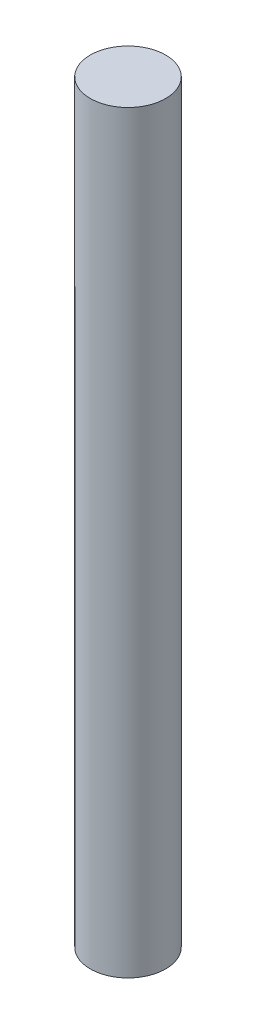
ISO-10303-21;
HEADER;
FILE_DESCRIPTION(('STEP AP214'),'2;1');
FILE_NAME('part.step','',(''),(''),'','','');
FILE_SCHEMA(('AUTOMOTIVE_DESIGN { 1 0 10303 214 1 1 1 1 }'));
ENDSEC;
DATA;
#1=APPLICATION_CONTEXT('core data for automotive mechanical design processes');
#2=APPLICATION_PROTOCOL_DEFINITION('international standard','automotive_design',2000,#1);
#3=PRODUCT_CONTEXT('',#1,'mechanical');
#4=PRODUCT('Part','Part','',(#3));
#5=PRODUCT_RELATED_PRODUCT_CATEGORY('part','',(#4));
#6=PRODUCT_DEFINITION_FORMATION('','',#4);
#7=PRODUCT_DEFINITION_CONTEXT('part definition',#1,'design');
#8=PRODUCT_DEFINITION('design','',#6,#7);
#9=PRODUCT_DEFINITION_SHAPE('','',#8);
#10=(LENGTH_UNIT() NAMED_UNIT(*) SI_UNIT(.MILLI.,.METRE.));
#11=(NAMED_UNIT(*) PLANE_ANGLE_UNIT() SI_UNIT($,.RADIAN.));
#12=(NAMED_UNIT(*) SI_UNIT($,.STERADIAN.) SOLID_ANGLE_UNIT());
#13=UNCERTAINTY_MEASURE_WITH_UNIT(LENGTH_MEASURE(1.E-05),#10,'distance_accuracy_value','');
#14=(GEOMETRIC_REPRESENTATION_CONTEXT(3) GLOBAL_UNCERTAINTY_ASSIGNED_CONTEXT((#13)) GLOBAL_UNIT_ASSIGNED_CONTEXT((#10,
#11,#12)) REPRESENTATION_CONTEXT('',''));
#15=CARTESIAN_POINT('',(0.,0.,0.));
#16=DIRECTION('',(0.,0.,1.));
#17=DIRECTION('',(1.,0.,0.));
#18=AXIS2_PLACEMENT_3D('',#15,#16,#17);
#19=CARTESIAN_POINT('',(3.74999999999999,75.,0.));
#20=DIRECTION('',(0.,1.,0.));
#21=DIRECTION('',(-1.,0.,0.));
#22=AXIS2_PLACEMENT_3D('',#19,#20,#21);
#23=CYLINDRICAL_SURFACE('',#22,7.5);
#24=CARTESIAN_POINT('',(3.75000000000001,-75.,0.));
#25=DIRECTION('',(0.,1.,0.));
#26=DIRECTION('',(-1.,0.,0.));
#27=AXIS2_PLACEMENT_3D('',#24,#25,#26);
#28=CIRCLE('',#27,7.5);
#29=CARTESIAN_POINT('',(-3.74999999999999,-75.,0.));
#30=VERTEX_POINT('',#29);
#31=EDGE_CURVE('E347',#30,#30,#28,.T.);
#32=ORIENTED_EDGE('',*,*,#31,.T.);
#33=EDGE_LOOP('',(#32));
#34=FACE_BOUND('',#33,.T.);
#35=CARTESIAN_POINT('',(3.75,-15.7500000000014,0.));
#36=DIRECTION('',(-0.739940073395888,0.672672793996374,0.));
#37=DIRECTION('',(0.672672793996374,0.739940073395888,0.));
#38=AXIS2_PLACEMENT_3D('',#35,#36,#37);
#39=ELLIPSE('',#38,11.1495515604879,7.5);
#40=CARTESIAN_POINT('',(-3.68303437365925,-23.9263378110253,1.));
#41=VERTEX_POINT('',#40);
#42=CARTESIAN_POINT('',(-3.68303437365925,-23.9263378110253,-1.));
#43=VERTEX_POINT('',#42);
#44=EDGE_CURVE('E34',#41,#43,#39,.F.);
#45=ORIENTED_EDGE('',*,*,#44,.T.);
#46=DIRECTION('',(0.,1.,0.));
#47=VECTOR('',#46,1.);
#48=CARTESIAN_POINT('',(-3.68303437365926,75.,-1.));
#49=LINE('',#48,#47);
#50=CARTESIAN_POINT('',(-3.68303437365925,-13.0736621889747,-1.));
#51=VERTEX_POINT('',#50);
#52=EDGE_CURVE('E11',#43,#51,#49,.T.);
#53=ORIENTED_EDGE('',*,*,#52,.T.);
#54=CARTESIAN_POINT('',(3.75,-21.2499999999986,0.));
#55=DIRECTION('',(-0.73994007339589,-0.672672793996371,0.));
#56=DIRECTION('',(-0.672672793996371,0.73994007339589,0.));
#57=AXIS2_PLACEMENT_3D('',#54,#55,#56);
#58=ELLIPSE('',#57,11.1495515604879,7.5);
#59=CARTESIAN_POINT('',(-3.75,-12.9999999999999,0.));
#60=VERTEX_POINT('',#59);
#61=EDGE_CURVE('E39',#51,#60,#58,.F.);
#62=ORIENTED_EDGE('',*,*,#61,.T.);
#63=CARTESIAN_POINT('',(3.75,-4.75000000000152,0.));
#64=DIRECTION('',(-0.739940073395887,0.672672793996375,0.));
#65=DIRECTION('',(0.672672793996375,0.739940073395887,0.));
#66=AXIS2_PLACEMENT_3D('',#63,#64,#65);
#67=ELLIPSE('',#66,11.1495515604878,7.5);
#68=CARTESIAN_POINT('',(-3.68303437365927,-12.9263378110254,-1.));
#69=VERTEX_POINT('',#68);
#70=EDGE_CURVE('E441',#60,#69,#67,.F.);
#71=ORIENTED_EDGE('',*,*,#70,.T.);
#72=CARTESIAN_POINT('',(-3.68303437365927,-2.07366218897477,-1.));
#73=VERTEX_POINT('',#72);
#74=EDGE_CURVE('E41',#69,#73,#49,.T.);
#75=ORIENTED_EDGE('',*,*,#74,.T.);
#76=CARTESIAN_POINT('',(3.75,-10.2499999999987,0.));
#77=DIRECTION('',(-0.73994007339589,-0.672672793996371,0.));
#78=DIRECTION('',(-0.672672793996371,0.73994007339589,0.));
#79=AXIS2_PLACEMENT_3D('',#76,#77,#78);
#80=ELLIPSE('',#79,11.1495515604879,7.5);
#81=CARTESIAN_POINT('',(-3.75,-1.99999999999998,0.));
#82=VERTEX_POINT('',#81);
#83=EDGE_CURVE('E437',#73,#82,#80,.F.);
#84=ORIENTED_EDGE('',*,*,#83,.T.);
#85=CARTESIAN_POINT('',(3.75,6.24999999999837,0.));
#86=DIRECTION('',(0.739940073395888,-0.672672793996374,0.));
#87=DIRECTION('',(0.672672793996374,0.739940073395888,0.));
#88=AXIS2_PLACEMENT_3D('',#85,#86,#87);
#89=ELLIPSE('',#88,11.1495515604879,7.5);
#90=CARTESIAN_POINT('',(-3.68303437365926,-1.92633781102547,-1.));
#91=VERTEX_POINT('',#90);
#92=EDGE_CURVE('E432',#91,#82,#89,.F.);
#93=ORIENTED_EDGE('',*,*,#92,.F.);
#94=CARTESIAN_POINT('',(-3.68303437365926,8.92633781102513,-1.));
#95=VERTEX_POINT('',#94);
#96=EDGE_CURVE('E435',#91,#95,#49,.T.);
#97=ORIENTED_EDGE('',*,*,#96,.T.);
#98=CARTESIAN_POINT('',(3.75,0.75000000000125,0.));
#99=DIRECTION('',(-0.73994007339589,-0.672672793996371,0.));
#100=DIRECTION('',(-0.672672793996371,0.73994007339589,0.));
#101=AXIS2_PLACEMENT_3D('',#98,#99,#100);
#102=ELLIPSE('',#101,11.1495515604879,7.5);
#103=CARTESIAN_POINT('',(-3.75,8.99999999999993,0.));
#104=VERTEX_POINT('',#103);
#105=EDGE_CURVE('E427',#95,#104,#102,.F.);
#106=ORIENTED_EDGE('',*,*,#105,.T.);
#107=CARTESIAN_POINT('',(3.75,17.2499999999982,0.));
#108=DIRECTION('',(-0.739940073395888,0.672672793996373,0.));
#109=DIRECTION('',(0.672672793996373,0.739940073395888,0.));
#110=AXIS2_PLACEMENT_3D('',#107,#108,#109);
#111=ELLIPSE('',#110,11.1495515604879,7.5);
#112=CARTESIAN_POINT('',(-3.68303437365925,9.0736621889744,-1.));
#113=VERTEX_POINT('',#112);
#114=EDGE_CURVE('E424',#104,#113,#111,.F.);
#115=ORIENTED_EDGE('',*,*,#114,.T.);
#116=CARTESIAN_POINT('',(-3.68303437365926,19.9263378110251,-1.));
#117=VERTEX_POINT('',#116);
#118=EDGE_CURVE('E644',#113,#117,#49,.T.);
#119=ORIENTED_EDGE('',*,*,#118,.T.);
#120=CARTESIAN_POINT('',(3.75,11.7500000000012,0.));
#121=DIRECTION('',(-0.739940073395891,-0.672672793996371,0.));
#122=DIRECTION('',(-0.672672793996371,0.739940073395891,0.));
#123=AXIS2_PLACEMENT_3D('',#120,#121,#122);
#124=ELLIPSE('',#123,11.1495515604879,7.5);
#125=CARTESIAN_POINT('',(-3.75,19.9999999999999,0.));
#126=VERTEX_POINT('',#125);
#127=EDGE_CURVE('E428',#117,#126,#124,.F.);
#128=ORIENTED_EDGE('',*,*,#127,.T.);
#129=CARTESIAN_POINT('',(3.75,28.249999999998,0.));
#130=DIRECTION('',(-0.739940073395887,0.672672793996375,0.));
#131=DIRECTION('',(0.672672793996375,0.739940073395887,0.));
#132=AXIS2_PLACEMENT_3D('',#129,#130,#131);
#133=ELLIPSE('',#132,11.1495515604878,7.5);
#134=CARTESIAN_POINT('',(-3.68303437365926,20.0736621889742,-1.));
#135=VERTEX_POINT('',#134);
#136=EDGE_CURVE('E414',#126,#135,#133,.F.);
#137=ORIENTED_EDGE('',*,*,#136,.T.);
#138=CARTESIAN_POINT('',(-3.68303437365925,30.9263378110249,-1.));
#139=VERTEX_POINT('',#138);
#140=EDGE_CURVE('E418',#135,#139,#49,.T.);
#141=ORIENTED_EDGE('',*,*,#140,.T.);
#142=CARTESIAN_POINT('',(3.75,22.750000000001,0.));
#143=DIRECTION('',(-0.73994007339589,-0.672672793996371,0.));
#144=DIRECTION('',(-0.672672793996371,0.739940073395891,0.));
#145=AXIS2_PLACEMENT_3D('',#142,#143,#144);
#146=ELLIPSE('',#145,11.1495515604879,7.5);
#147=CARTESIAN_POINT('',(-3.75000000000001,30.9999999999997,0.));
#148=VERTEX_POINT('',#147);
#149=EDGE_CURVE('E409',#139,#148,#146,.F.);
#150=ORIENTED_EDGE('',*,*,#149,.T.);
#151=CARTESIAN_POINT('',(3.74999999999999,39.2499999999979,0.));
#152=DIRECTION('',(-0.739940073395888,0.672672793996374,0.));
#153=DIRECTION('',(0.672672793996374,0.739940073395888,0.));
#154=AXIS2_PLACEMENT_3D('',#151,#152,#153);
#155=ELLIPSE('',#154,11.1495515604879,7.5);
#156=CARTESIAN_POINT('',(-3.68303437365925,31.0736621889741,-1.));
#157=VERTEX_POINT('',#156);
#158=EDGE_CURVE('E406',#148,#157,#155,.F.);
#159=ORIENTED_EDGE('',*,*,#158,.T.);
#160=CARTESIAN_POINT('',(-3.68303437365925,41.9263378110248,-1.));
#161=VERTEX_POINT('',#160);
#162=EDGE_CURVE('E647',#157,#161,#49,.T.);
#163=ORIENTED_EDGE('',*,*,#162,.T.);
#164=CARTESIAN_POINT('',(3.74999999999999,33.7500000000009,0.));
#165=DIRECTION('',(-0.739940073395891,-0.67267279399637,0.));
#166=DIRECTION('',(-0.67267279399637,0.739940073395891,0.));
#167=AXIS2_PLACEMENT_3D('',#164,#165,#166);
#168=ELLIPSE('',#167,11.1495515604879,7.5);
#169=CARTESIAN_POINT('',(-3.75000000000001,41.9999999999996,0.));
#170=VERTEX_POINT('',#169);
#171=EDGE_CURVE('E410',#161,#170,#168,.F.);
#172=ORIENTED_EDGE('',*,*,#171,.T.);
#173=CARTESIAN_POINT('',(3.74999999999999,50.2499999999978,0.));
#174=DIRECTION('',(-0.739940073395888,0.672672793996374,0.));
#175=DIRECTION('',(0.672672793996374,0.739940073395888,0.));
#176=AXIS2_PLACEMENT_3D('',#173,#174,#175);
#177=ELLIPSE('',#176,11.1495515604879,7.5);
#178=CARTESIAN_POINT('',(-3.68303437365927,42.0736621889739,-1.));
#179=VERTEX_POINT('',#178);
#180=EDGE_CURVE('E396',#170,#179,#177,.F.);
#181=ORIENTED_EDGE('',*,*,#180,.T.);
#182=CARTESIAN_POINT('',(-3.68303437365925,52.9263378110247,-1.));
#183=VERTEX_POINT('',#182);
#184=EDGE_CURVE('E400',#179,#183,#49,.T.);
#185=ORIENTED_EDGE('',*,*,#184,.T.);
#186=CARTESIAN_POINT('',(3.74999999999999,44.7500000000008,0.));
#187=DIRECTION('',(-0.73994007339589,-0.672672793996371,0.));
#188=DIRECTION('',(-0.672672793996371,0.73994007339589,0.));
#189=AXIS2_PLACEMENT_3D('',#186,#187,#188);
#190=ELLIPSE('',#189,11.1495515604879,7.5);
#191=CARTESIAN_POINT('',(-3.75000000000001,52.9999999999995,0.));
#192=VERTEX_POINT('',#191);
#193=EDGE_CURVE('E391',#183,#192,#190,.F.);
#194=ORIENTED_EDGE('',*,*,#193,.T.);
#195=CARTESIAN_POINT('',(3.74999999999999,61.2499999999976,0.));
#196=DIRECTION('',(-0.739940073395887,0.672672793996375,0.));
#197=DIRECTION('',(0.672672793996375,0.739940073395887,0.));
#198=AXIS2_PLACEMENT_3D('',#195,#196,#197);
#199=ELLIPSE('',#198,11.1495515604878,7.5);
#200=CARTESIAN_POINT('',(-3.68303437365928,53.0736621889738,-1.));
#201=VERTEX_POINT('',#200);
#202=EDGE_CURVE('E388',#192,#201,#199,.F.);
#203=ORIENTED_EDGE('',*,*,#202,.T.);
#204=CARTESIAN_POINT('',(-3.68303437365926,63.9263378110246,-1.));
#205=VERTEX_POINT('',#204);
#206=EDGE_CURVE('E383',#201,#205,#49,.T.);
#207=ORIENTED_EDGE('',*,*,#206,.T.);
#208=CARTESIAN_POINT('',(3.74999999999999,55.7500000000007,0.));
#209=DIRECTION('',(-0.739940073395891,-0.672672793996371,0.));
#210=DIRECTION('',(-0.672672793996371,0.739940073395891,0.));
#211=AXIS2_PLACEMENT_3D('',#208,#209,#210);
#212=ELLIPSE('',#211,11.1495515604879,7.5);
#213=CARTESIAN_POINT('',(-3.75000000000001,63.9999999999994,0.));
#214=VERTEX_POINT('',#213);
#215=EDGE_CURVE('E392',#205,#214,#212,.F.);
#216=ORIENTED_EDGE('',*,*,#215,.T.);
#217=CARTESIAN_POINT('',(3.74999999999999,72.2499999999974,0.));
#218=DIRECTION('',(0.739940073395887,-0.672672793996375,0.));
#219=DIRECTION('',(0.672672793996375,0.739940073395887,0.));
#220=AXIS2_PLACEMENT_3D('',#217,#218,#219);
#221=ELLIPSE('',#220,11.1495515604878,7.5);
#222=CARTESIAN_POINT('',(-3.68303437365925,64.0736621889736,-1.));
#223=VERTEX_POINT('',#222);
#224=EDGE_CURVE('E379',#223,#214,#221,.F.);
#225=ORIENTED_EDGE('',*,*,#224,.F.);
#226=CARTESIAN_POINT('',(-3.68303437365927,74.9263378110252,-1.));
#227=VERTEX_POINT('',#226);
#228=EDGE_CURVE('E42',#223,#227,#49,.T.);
#229=ORIENTED_EDGE('',*,*,#228,.T.);
#230=CARTESIAN_POINT('',(3.74999999999999,66.7500000000013,0.));
#231=DIRECTION('',(-0.739940073395891,-0.672672793996371,0.));
#232=DIRECTION('',(-0.672672793996371,0.739940073395891,0.));
#233=AXIS2_PLACEMENT_3D('',#230,#231,#232);
#234=ELLIPSE('',#233,11.1495515604879,7.5);
#235=CARTESIAN_POINT('',(-3.75000000000001,75.,0.));
#236=VERTEX_POINT('',#235);
#237=EDGE_CURVE('E380',#227,#236,#234,.F.);
#238=ORIENTED_EDGE('',*,*,#237,.T.);
#239=CARTESIAN_POINT('',(3.74999999999999,75.,0.));
#240=DIRECTION('',(0.,1.,0.));
#241=DIRECTION('',(-1.,0.,0.));
#242=AXIS2_PLACEMENT_3D('',#239,#240,#241);
#243=CIRCLE('',#242,7.5);
#244=EDGE_CURVE('E370',#236,#236,#243,.T.);
#245=ORIENTED_EDGE('',*,*,#244,.F.);
#246=CARTESIAN_POINT('',(-3.68303437365927,74.9263378110252,1.));
#247=VERTEX_POINT('',#246);
#248=EDGE_CURVE('E57',#236,#247,#234,.F.);
#249=ORIENTED_EDGE('',*,*,#248,.T.);
#250=DIRECTION('',(0.,1.,0.));
#251=VECTOR('',#250,1.);
#252=CARTESIAN_POINT('',(-3.68303437365926,75.,1.));
#253=LINE('',#252,#251);
#254=CARTESIAN_POINT('',(-3.68303437365925,64.0736621889736,1.));
#255=VERTEX_POINT('',#254);
#256=EDGE_CURVE('E373',#255,#247,#253,.T.);
#257=ORIENTED_EDGE('',*,*,#256,.F.);
#258=EDGE_CURVE('E375',#214,#255,#221,.F.);
#259=ORIENTED_EDGE('',*,*,#258,.F.);
#260=CARTESIAN_POINT('',(-3.68303437365926,63.9263378110246,1.));
#261=VERTEX_POINT('',#260);
#262=EDGE_CURVE('E387',#214,#261,#212,.F.);
#263=ORIENTED_EDGE('',*,*,#262,.T.);
#264=CARTESIAN_POINT('',(-3.68303437365928,53.0736621889738,1.));
#265=VERTEX_POINT('',#264);
#266=EDGE_CURVE('E377',#265,#261,#253,.T.);
#267=ORIENTED_EDGE('',*,*,#266,.F.);
#268=EDGE_CURVE('E384',#265,#192,#199,.F.);
#269=ORIENTED_EDGE('',*,*,#268,.T.);
#270=CARTESIAN_POINT('',(-3.68303437365925,52.9263378110247,1.));
#271=VERTEX_POINT('',#270);
#272=EDGE_CURVE('E395',#192,#271,#190,.F.);
#273=ORIENTED_EDGE('',*,*,#272,.T.);
#274=CARTESIAN_POINT('',(-3.68303437365927,42.0736621889739,1.));
#275=VERTEX_POINT('',#274);
#276=EDGE_CURVE('E475',#275,#271,#253,.T.);
#277=ORIENTED_EDGE('',*,*,#276,.F.);
#278=EDGE_CURVE('E399',#275,#170,#177,.F.);
#279=ORIENTED_EDGE('',*,*,#278,.T.);
#280=CARTESIAN_POINT('',(-3.68303437365925,41.9263378110248,1.));
#281=VERTEX_POINT('',#280);
#282=EDGE_CURVE('E404',#170,#281,#168,.F.);
#283=ORIENTED_EDGE('',*,*,#282,.T.);
#284=CARTESIAN_POINT('',(-3.68303437365925,31.0736621889741,1.));
#285=VERTEX_POINT('',#284);
#286=EDGE_CURVE('E405',#285,#281,#253,.T.);
#287=ORIENTED_EDGE('',*,*,#286,.F.);
#288=EDGE_CURVE('E401',#285,#148,#155,.F.);
#289=ORIENTED_EDGE('',*,*,#288,.T.);
#290=CARTESIAN_POINT('',(-3.68303437365925,30.9263378110249,1.));
#291=VERTEX_POINT('',#290);
#292=EDGE_CURVE('E413',#148,#291,#146,.F.);
#293=ORIENTED_EDGE('',*,*,#292,.T.);
#294=CARTESIAN_POINT('',(-3.68303437365926,20.0736621889742,1.));
#295=VERTEX_POINT('',#294);
#296=EDGE_CURVE('E466',#295,#291,#253,.T.);
#297=ORIENTED_EDGE('',*,*,#296,.F.);
#298=EDGE_CURVE('E417',#295,#126,#133,.F.);
#299=ORIENTED_EDGE('',*,*,#298,.T.);
#300=CARTESIAN_POINT('',(-3.68303437365926,19.9263378110251,1.));
#301=VERTEX_POINT('',#300);
#302=EDGE_CURVE('E422',#126,#301,#124,.F.);
#303=ORIENTED_EDGE('',*,*,#302,.T.);
#304=CARTESIAN_POINT('',(-3.68303437365925,9.0736621889744,1.));
#305=VERTEX_POINT('',#304);
#306=EDGE_CURVE('E423',#305,#301,#253,.T.);
#307=ORIENTED_EDGE('',*,*,#306,.F.);
#308=EDGE_CURVE('E419',#305,#104,#111,.F.);
#309=ORIENTED_EDGE('',*,*,#308,.T.);
#310=CARTESIAN_POINT('',(-3.68303437365926,8.92633781102513,1.));
#311=VERTEX_POINT('',#310);
#312=EDGE_CURVE('E431',#104,#311,#102,.F.);
#313=ORIENTED_EDGE('',*,*,#312,.T.);
#314=CARTESIAN_POINT('',(-3.68303437365926,-1.92633781102547,1.));
#315=VERTEX_POINT('',#314);
#316=EDGE_CURVE('E459',#315,#311,#253,.T.);
#317=ORIENTED_EDGE('',*,*,#316,.F.);
#318=EDGE_CURVE('E436',#82,#315,#89,.F.);
#319=ORIENTED_EDGE('',*,*,#318,.F.);
#320=CARTESIAN_POINT('',(-3.68303437365927,-2.07366218897477,1.));
#321=VERTEX_POINT('',#320);
#322=EDGE_CURVE('E440',#82,#321,#80,.F.);
#323=ORIENTED_EDGE('',*,*,#322,.T.);
#324=CARTESIAN_POINT('',(-3.68303437365927,-12.9263378110254,1.));
#325=VERTEX_POINT('',#324);
#326=EDGE_CURVE('E449',#325,#321,#253,.T.);
#327=ORIENTED_EDGE('',*,*,#326,.F.);
#328=EDGE_CURVE('E443',#325,#60,#67,.F.);
#329=ORIENTED_EDGE('',*,*,#328,.T.);
#330=CARTESIAN_POINT('',(-3.68303437365925,-13.0736621889747,1.));
#331=VERTEX_POINT('',#330);
#332=EDGE_CURVE('E444',#60,#331,#58,.F.);
#333=ORIENTED_EDGE('',*,*,#332,.T.);
#334=EDGE_CURVE('E376',#41,#331,#253,.T.);
#335=ORIENTED_EDGE('',*,*,#334,.F.);
#336=EDGE_LOOP('',(#45,#53,#62,#71,#75,#84,#93,#97,#106,#115,#119,#128,#137,#141,#150,#159,#163,
#172,#181,#185,#194,#203,#207,#216,#225,#229,#238,#245,#249,#257,#259,#263,#267,#269,#273,#277,
#279,#283,#287,#289,#293,#297,#299,#303,#307,#309,#313,#317,#319,#323,#327,#329,#333,#335));
#337=FACE_BOUND('',#336,.T.);
#338=ADVANCED_FACE('F30',(#34,#337),#23,.T.);
#339=CARTESIAN_POINT('',(-3.75000000000001,75.,0.));
#340=DIRECTION('',(0.,1.,0.));
#341=DIRECTION('',(-1.,0.,0.));
#342=AXIS2_PLACEMENT_3D('',#339,#340,#341);
#343=PLANE('',#342);
#344=ORIENTED_EDGE('',*,*,#244,.T.);
#345=EDGE_LOOP('',(#344));
#346=FACE_BOUND('',#345,.T.);
#347=ADVANCED_FACE('F32',(#346),#343,.T.);
#348=CARTESIAN_POINT('',(-3.74999999999999,-75.,0.));
#349=DIRECTION('',(0.,-1.,0.));
#350=DIRECTION('',(1.,0.,0.));
#351=AXIS2_PLACEMENT_3D('',#348,#349,#350);
#352=PLANE('',#351);
#353=ORIENTED_EDGE('',*,*,#31,.F.);
#354=EDGE_LOOP('',(#353));
#355=FACE_BOUND('',#354,.T.);
#356=ADVANCED_FACE('F492',(#355),#352,.T.);
#357=CARTESIAN_POINT('',(-13.3499999999976,-128.278803065954,1.));
#358=DIRECTION('',(0.,0.,1.));
#359=DIRECTION('',(1.,0.,0.));
#360=AXIS2_PLACEMENT_3D('',#357,#358,#359);
#361=PLANE('',#360);
#362=ORIENTED_EDGE('',*,*,#256,.T.);
#363=DIRECTION('',(0.672672793996371,-0.739940073395891,0.));
#364=VECTOR('',#363,1.);
#365=CARTESIAN_POINT('',(93.085603335997,-31.5191636695798,1.));
#366=LINE('',#365,#364);
#367=CARTESIAN_POINT('',(1.25000000000137,69.4999999999994,1.));
#368=VERTEX_POINT('',#367);
#369=EDGE_CURVE('E263',#247,#368,#366,.T.);
#370=ORIENTED_EDGE('',*,*,#369,.T.);
#371=DIRECTION('',(0.672672793996375,0.739940073395887,0.));
#372=VECTOR('',#371,1.);
#373=CARTESIAN_POINT('',(-103.798273019254,-46.0531003211615,1.));
#374=LINE('',#373,#372);
#375=EDGE_CURVE('E49',#255,#368,#374,.T.);
#376=ORIENTED_EDGE('',*,*,#375,.F.);
#377=EDGE_LOOP('',(#362,#370,#376));
#378=FACE_BOUND('',#377,.T.);
#379=ADVANCED_FACE('F497',(#378),#361,.F.);
#380=CARTESIAN_POINT('',(-13.3499999999976,-128.278803065954,-1.));
#381=DIRECTION('',(0.,0.,1.));
#382=DIRECTION('',(1.,0.,0.));
#383=AXIS2_PLACEMENT_3D('',#380,#381,#382);
#384=PLANE('',#383);
#385=DIRECTION('',(0.672672793996375,0.739940073395887,0.));
#386=VECTOR('',#385,1.);
#387=CARTESIAN_POINT('',(-103.798273019254,-46.0531003211615,-1.));
#388=LINE('',#387,#386);
#389=CARTESIAN_POINT('',(1.25000000000137,69.4999999999994,-1.));
#390=VERTEX_POINT('',#389);
#391=EDGE_CURVE('E301',#223,#390,#388,.T.);
#392=ORIENTED_EDGE('',*,*,#391,.T.);
#393=DIRECTION('',(0.672672793996371,-0.739940073395891,0.));
#394=VECTOR('',#393,1.);
#395=CARTESIAN_POINT('',(93.085603335997,-31.5191636695798,-1.));
#396=LINE('',#395,#394);
#397=EDGE_CURVE('E260',#227,#390,#396,.T.);
#398=ORIENTED_EDGE('',*,*,#397,.F.);
#399=ORIENTED_EDGE('',*,*,#228,.F.);
#400=EDGE_LOOP('',(#392,#398,#399));
#401=FACE_BOUND('',#400,.T.);
#402=ADVANCED_FACE('F580',(#401),#384,.T.);
#403=CARTESIAN_POINT('',(-103.798273019254,-46.0531003211615,-1.));
#404=DIRECTION('',(0.739940073395887,-0.672672793996375,0.));
#405=DIRECTION('',(0.672672793996375,0.739940073395887,0.));
#406=AXIS2_PLACEMENT_3D('',#403,#404,#405);
#407=PLANE('',#406);
#408=ORIENTED_EDGE('',*,*,#224,.T.);
#409=ORIENTED_EDGE('',*,*,#258,.T.);
#410=ORIENTED_EDGE('',*,*,#375,.T.);
#411=DIRECTION('',(0.,0.,1.));
#412=VECTOR('',#411,1.);
#413=CARTESIAN_POINT('',(1.25000000000137,69.4999999999994,-1.));
#414=LINE('',#413,#412);
#415=EDGE_CURVE('E344',#390,#368,#414,.T.);
#416=ORIENTED_EDGE('',*,*,#415,.F.);
#417=ORIENTED_EDGE('',*,*,#391,.F.);
#418=EDGE_LOOP('',(#408,#409,#410,#416,#417));
#419=FACE_BOUND('',#418,.T.);
#420=ADVANCED_FACE('F576',(#419),#407,.F.);
#421=CARTESIAN_POINT('',(93.085603335997,-31.5191636695798,-1.));
#422=DIRECTION('',(-0.739940073395891,-0.672672793996371,0.));
#423=DIRECTION('',(0.672672793996371,-0.739940073395891,0.));
#424=AXIS2_PLACEMENT_3D('',#421,#422,#423);
#425=PLANE('',#424);
#426=ORIENTED_EDGE('',*,*,#237,.F.);
#427=ORIENTED_EDGE('',*,*,#397,.T.);
#428=ORIENTED_EDGE('',*,*,#415,.T.);
#429=ORIENTED_EDGE('',*,*,#369,.F.);
#430=ORIENTED_EDGE('',*,*,#248,.F.);
#431=EDGE_LOOP('',(#426,#427,#428,#429,#430));
#432=FACE_BOUND('',#431,.T.);
#433=ADVANCED_FACE('F579',(#432),#425,.T.);
#434=DIRECTION('',(-0.672672793996375,-0.739940073395887,0.));
#435=VECTOR('',#434,1.);
#436=CARTESIAN_POINT('',(-98.3231598970817,-51.0304758867732,-1.));
#437=LINE('',#436,#435);
#438=CARTESIAN_POINT('',(1.25000000000101,58.4999999999992,-1.));
#439=VERTEX_POINT('',#438);
#440=EDGE_CURVE('E296',#439,#201,#437,.T.);
#441=ORIENTED_EDGE('',*,*,#440,.F.);
#442=DIRECTION('',(0.672672793996371,-0.739940073395891,0.));
#443=VECTOR('',#442,1.);
#444=CARTESIAN_POINT('',(87.6104902138246,-36.4965392351918,-1.));
#445=LINE('',#444,#443);
#446=EDGE_CURVE('E299',#205,#439,#445,.T.);
#447=ORIENTED_EDGE('',*,*,#446,.F.);
#448=ORIENTED_EDGE('',*,*,#206,.F.);
#449=EDGE_LOOP('',(#441,#447,#448));
#450=FACE_BOUND('',#449,.T.);
#451=ADVANCED_FACE('F584',(#450),#384,.T.);
#452=ORIENTED_EDGE('',*,*,#266,.T.);
#453=DIRECTION('',(0.672672793996371,-0.739940073395891,0.));
#454=VECTOR('',#453,1.);
#455=CARTESIAN_POINT('',(87.6104902138246,-36.4965392351918,1.));
#456=LINE('',#455,#454);
#457=CARTESIAN_POINT('',(1.25000000000101,58.4999999999992,1.));
#458=VERTEX_POINT('',#457);
#459=EDGE_CURVE('E341',#261,#458,#456,.T.);
#460=ORIENTED_EDGE('',*,*,#459,.T.);
#461=DIRECTION('',(-0.672672793996375,-0.739940073395887,0.));
#462=VECTOR('',#461,1.);
#463=CARTESIAN_POINT('',(-98.3231598970817,-51.0304758867732,1.));
#464=LINE('',#463,#462);
#465=EDGE_CURVE('E338',#458,#265,#464,.T.);
#466=ORIENTED_EDGE('',*,*,#465,.T.);
#467=EDGE_LOOP('',(#452,#460,#466));
#468=FACE_BOUND('',#467,.T.);
#469=ADVANCED_FACE('F570',(#468),#361,.F.);
#470=CARTESIAN_POINT('',(-98.3231598970817,-51.0304758867732,-1.));
#471=DIRECTION('',(-0.739940073395887,0.672672793996375,0.));
#472=DIRECTION('',(-0.672672793996375,-0.739940073395887,0.));
#473=AXIS2_PLACEMENT_3D('',#470,#471,#472);
#474=PLANE('',#473);
#475=ORIENTED_EDGE('',*,*,#465,.F.);
#476=DIRECTION('',(0.,0.,1.));
#477=VECTOR('',#476,1.);
#478=CARTESIAN_POINT('',(1.25000000000101,58.4999999999992,-1.));
#479=LINE('',#478,#477);
#480=EDGE_CURVE('E348',#439,#458,#479,.T.);
#481=ORIENTED_EDGE('',*,*,#480,.F.);
#482=ORIENTED_EDGE('',*,*,#440,.T.);
#483=ORIENTED_EDGE('',*,*,#202,.F.);
#484=ORIENTED_EDGE('',*,*,#268,.F.);
#485=EDGE_LOOP('',(#475,#481,#482,#483,#484));
#486=FACE_BOUND('',#485,.T.);
#487=ADVANCED_FACE('F566',(#486),#474,.T.);
#488=CARTESIAN_POINT('',(87.6104902138246,-36.4965392351918,-1.));
#489=DIRECTION('',(-0.739940073395891,-0.672672793996371,0.));
#490=DIRECTION('',(0.672672793996371,-0.739940073395891,0.));
#491=AXIS2_PLACEMENT_3D('',#488,#489,#490);
#492=PLANE('',#491);
#493=ORIENTED_EDGE('',*,*,#215,.F.);
#494=ORIENTED_EDGE('',*,*,#446,.T.);
#495=ORIENTED_EDGE('',*,*,#480,.T.);
#496=ORIENTED_EDGE('',*,*,#459,.F.);
#497=ORIENTED_EDGE('',*,*,#262,.F.);
#498=EDGE_LOOP('',(#493,#494,#495,#496,#497));
#499=FACE_BOUND('',#498,.T.);
#500=ADVANCED_FACE('F569',(#499),#492,.T.);
#501=DIRECTION('',(-0.672672793996374,-0.739940073395888,0.));
#502=VECTOR('',#501,1.);
#503=CARTESIAN_POINT('',(-92.8480467749097,-56.0078514523853,-1.));
#504=LINE('',#503,#502);
#505=CARTESIAN_POINT('',(1.25000000000099,47.4999999999993,-1.));
#506=VERTEX_POINT('',#505);
#507=EDGE_CURVE('E291',#506,#179,#504,.T.);
#508=ORIENTED_EDGE('',*,*,#507,.F.);
#509=DIRECTION('',(0.672672793996371,-0.73994007339589,0.));
#510=VECTOR('',#509,1.);
#511=CARTESIAN_POINT('',(82.1353770916527,-41.4739148008034,-1.));
#512=LINE('',#511,#510);
#513=EDGE_CURVE('E294',#183,#506,#512,.T.);
#514=ORIENTED_EDGE('',*,*,#513,.F.);
#515=ORIENTED_EDGE('',*,*,#184,.F.);
#516=EDGE_LOOP('',(#508,#514,#515));
#517=FACE_BOUND('',#516,.T.);
#518=ADVANCED_FACE('F574',(#517),#384,.T.);
#519=ORIENTED_EDGE('',*,*,#276,.T.);
#520=DIRECTION('',(0.672672793996371,-0.73994007339589,0.));
#521=VECTOR('',#520,1.);
#522=CARTESIAN_POINT('',(82.1353770916527,-41.4739148008034,1.));
#523=LINE('',#522,#521);
#524=CARTESIAN_POINT('',(1.25000000000099,47.4999999999993,1.));
#525=VERTEX_POINT('',#524);
#526=EDGE_CURVE('E336',#271,#525,#523,.T.);
#527=ORIENTED_EDGE('',*,*,#526,.T.);
#528=DIRECTION('',(-0.672672793996374,-0.739940073395888,0.));
#529=VECTOR('',#528,1.);
#530=CARTESIAN_POINT('',(-92.8480467749097,-56.0078514523853,1.));
#531=LINE('',#530,#529);
#532=EDGE_CURVE('E333',#525,#275,#531,.T.);
#533=ORIENTED_EDGE('',*,*,#532,.T.);
#534=EDGE_LOOP('',(#519,#527,#533));
#535=FACE_BOUND('',#534,.T.);
#536=ADVANCED_FACE('F560',(#535),#361,.F.);
#537=CARTESIAN_POINT('',(-92.8480467749097,-56.0078514523853,-1.));
#538=DIRECTION('',(-0.739940073395888,0.672672793996374,0.));
#539=DIRECTION('',(-0.672672793996374,-0.739940073395888,0.));
#540=AXIS2_PLACEMENT_3D('',#537,#538,#539);
#541=PLANE('',#540);
#542=ORIENTED_EDGE('',*,*,#532,.F.);
#543=DIRECTION('',(0.,0.,1.));
#544=VECTOR('',#543,1.);
#545=CARTESIAN_POINT('',(1.25000000000099,47.4999999999993,-1.));
#546=LINE('',#545,#544);
#547=EDGE_CURVE('E351',#506,#525,#546,.T.);
#548=ORIENTED_EDGE('',*,*,#547,.F.);
#549=ORIENTED_EDGE('',*,*,#507,.T.);
#550=ORIENTED_EDGE('',*,*,#180,.F.);
#551=ORIENTED_EDGE('',*,*,#278,.F.);
#552=EDGE_LOOP('',(#542,#548,#549,#550,#551));
#553=FACE_BOUND('',#552,.T.);
#554=ADVANCED_FACE('F556',(#553),#541,.T.);
#555=CARTESIAN_POINT('',(82.1353770916527,-41.4739148008034,-1.));
#556=DIRECTION('',(-0.73994007339589,-0.672672793996371,0.));
#557=DIRECTION('',(0.672672793996371,-0.73994007339589,0.));
#558=AXIS2_PLACEMENT_3D('',#555,#556,#557);
#559=PLANE('',#558);
#560=ORIENTED_EDGE('',*,*,#193,.F.);
#561=ORIENTED_EDGE('',*,*,#513,.T.);
#562=ORIENTED_EDGE('',*,*,#547,.T.);
#563=ORIENTED_EDGE('',*,*,#526,.F.);
#564=ORIENTED_EDGE('',*,*,#272,.F.);
#565=EDGE_LOOP('',(#560,#561,#562,#563,#564));
#566=FACE_BOUND('',#565,.T.);
#567=ADVANCED_FACE('F559',(#566),#559,.T.);
#568=DIRECTION('',(-0.672672793996374,-0.739940073395888,0.));
#569=VECTOR('',#568,1.);
#570=CARTESIAN_POINT('',(-87.3729336527377,-60.9852270179969,-1.));
#571=LINE('',#570,#569);
#572=CARTESIAN_POINT('',(1.25000000000094,36.4999999999994,-1.));
#573=VERTEX_POINT('',#572);
#574=EDGE_CURVE('E286',#573,#157,#571,.T.);
#575=ORIENTED_EDGE('',*,*,#574,.F.);
#576=DIRECTION('',(0.67267279399637,-0.739940073395891,0.));
#577=VECTOR('',#576,1.);
#578=CARTESIAN_POINT('',(76.6602639694807,-46.4512903664152,-1.));
#579=LINE('',#578,#577);
#580=EDGE_CURVE('E289',#161,#573,#579,.T.);
#581=ORIENTED_EDGE('',*,*,#580,.F.);
#582=ORIENTED_EDGE('',*,*,#162,.F.);
#583=EDGE_LOOP('',(#575,#581,#582));
#584=FACE_BOUND('',#583,.T.);
#585=ADVANCED_FACE('F564',(#584),#384,.T.);
#586=ORIENTED_EDGE('',*,*,#286,.T.);
#587=DIRECTION('',(0.67267279399637,-0.739940073395891,0.));
#588=VECTOR('',#587,1.);
#589=CARTESIAN_POINT('',(76.6602639694807,-46.4512903664152,1.));
#590=LINE('',#589,#588);
#591=CARTESIAN_POINT('',(1.25000000000094,36.4999999999994,1.));
#592=VERTEX_POINT('',#591);
#593=EDGE_CURVE('E331',#281,#592,#590,.T.);
#594=ORIENTED_EDGE('',*,*,#593,.T.);
#595=DIRECTION('',(-0.672672793996374,-0.739940073395888,0.));
#596=VECTOR('',#595,1.);
#597=CARTESIAN_POINT('',(-87.3729336527377,-60.9852270179969,1.));
#598=LINE('',#597,#596);
#599=EDGE_CURVE('E328',#592,#285,#598,.T.);
#600=ORIENTED_EDGE('',*,*,#599,.T.);
#601=EDGE_LOOP('',(#586,#594,#600));
#602=FACE_BOUND('',#601,.T.);
#603=ADVANCED_FACE('F550',(#602),#361,.F.);
#604=CARTESIAN_POINT('',(-87.3729336527377,-60.9852270179969,-1.));
#605=DIRECTION('',(-0.739940073395888,0.672672793996374,0.));
#606=DIRECTION('',(-0.672672793996374,-0.739940073395888,0.));
#607=AXIS2_PLACEMENT_3D('',#604,#605,#606);
#608=PLANE('',#607);
#609=ORIENTED_EDGE('',*,*,#599,.F.);
#610=DIRECTION('',(0.,0.,1.));
#611=VECTOR('',#610,1.);
#612=CARTESIAN_POINT('',(1.25000000000094,36.4999999999994,-1.));
#613=LINE('',#612,#611);
#614=EDGE_CURVE('E354',#573,#592,#613,.T.);
#615=ORIENTED_EDGE('',*,*,#614,.F.);
#616=ORIENTED_EDGE('',*,*,#574,.T.);
#617=ORIENTED_EDGE('',*,*,#158,.F.);
#618=ORIENTED_EDGE('',*,*,#288,.F.);
#619=EDGE_LOOP('',(#609,#615,#616,#617,#618));
#620=FACE_BOUND('',#619,.T.);
#621=ADVANCED_FACE('F546',(#620),#608,.T.);
#622=CARTESIAN_POINT('',(76.6602639694807,-46.4512903664152,-1.));
#623=DIRECTION('',(-0.739940073395891,-0.67267279399637,0.));
#624=DIRECTION('',(0.67267279399637,-0.739940073395891,0.));
#625=AXIS2_PLACEMENT_3D('',#622,#623,#624);
#626=PLANE('',#625);
#627=ORIENTED_EDGE('',*,*,#171,.F.);
#628=ORIENTED_EDGE('',*,*,#580,.T.);
#629=ORIENTED_EDGE('',*,*,#614,.T.);
#630=ORIENTED_EDGE('',*,*,#593,.F.);
#631=ORIENTED_EDGE('',*,*,#282,.F.);
#632=EDGE_LOOP('',(#627,#628,#629,#630,#631));
#633=FACE_BOUND('',#632,.T.);
#634=ADVANCED_FACE('F549',(#633),#626,.T.);
#635=DIRECTION('',(-0.672672793996375,-0.739940073395887,0.));
#636=VECTOR('',#635,1.);
#637=CARTESIAN_POINT('',(-81.8978205305659,-65.9626025836084,-1.));
#638=LINE('',#637,#636);
#639=CARTESIAN_POINT('',(1.25000000000097,25.4999999999995,-1.));
#640=VERTEX_POINT('',#639);
#641=EDGE_CURVE('E281',#640,#135,#638,.T.);
#642=ORIENTED_EDGE('',*,*,#641,.F.);
#643=DIRECTION('',(0.672672793996371,-0.739940073395891,0.));
#644=VECTOR('',#643,1.);
#645=CARTESIAN_POINT('',(71.1851508473087,-51.4286659320268,-1.));
#646=LINE('',#645,#644);
#647=EDGE_CURVE('E284',#139,#640,#646,.T.);
#648=ORIENTED_EDGE('',*,*,#647,.F.);
#649=ORIENTED_EDGE('',*,*,#140,.F.);
#650=EDGE_LOOP('',(#642,#648,#649));
#651=FACE_BOUND('',#650,.T.);
#652=ADVANCED_FACE('F554',(#651),#384,.T.);
#653=ORIENTED_EDGE('',*,*,#296,.T.);
#654=DIRECTION('',(0.672672793996371,-0.739940073395891,0.));
#655=VECTOR('',#654,1.);
#656=CARTESIAN_POINT('',(71.1851508473087,-51.4286659320268,1.));
#657=LINE('',#656,#655);
#658=CARTESIAN_POINT('',(1.25000000000097,25.4999999999995,1.));
#659=VERTEX_POINT('',#658);
#660=EDGE_CURVE('E326',#291,#659,#657,.T.);
#661=ORIENTED_EDGE('',*,*,#660,.T.);
#662=DIRECTION('',(-0.672672793996375,-0.739940073395887,0.));
#663=VECTOR('',#662,1.);
#664=CARTESIAN_POINT('',(-81.8978205305659,-65.9626025836084,1.));
#665=LINE('',#664,#663);
#666=EDGE_CURVE('E323',#659,#295,#665,.T.);
#667=ORIENTED_EDGE('',*,*,#666,.T.);
#668=EDGE_LOOP('',(#653,#661,#667));
#669=FACE_BOUND('',#668,.T.);
#670=ADVANCED_FACE('F540',(#669),#361,.F.);
#671=CARTESIAN_POINT('',(-81.8978205305659,-65.9626025836084,-1.));
#672=DIRECTION('',(-0.739940073395887,0.672672793996375,0.));
#673=DIRECTION('',(-0.672672793996375,-0.739940073395887,0.));
#674=AXIS2_PLACEMENT_3D('',#671,#672,#673);
#675=PLANE('',#674);
#676=ORIENTED_EDGE('',*,*,#666,.F.);
#677=DIRECTION('',(0.,0.,1.));
#678=VECTOR('',#677,1.);
#679=CARTESIAN_POINT('',(1.25000000000097,25.4999999999995,-1.));
#680=LINE('',#679,#678);
#681=EDGE_CURVE('E357',#640,#659,#680,.T.);
#682=ORIENTED_EDGE('',*,*,#681,.F.);
#683=ORIENTED_EDGE('',*,*,#641,.T.);
#684=ORIENTED_EDGE('',*,*,#136,.F.);
#685=ORIENTED_EDGE('',*,*,#298,.F.);
#686=EDGE_LOOP('',(#676,#682,#683,#684,#685));
#687=FACE_BOUND('',#686,.T.);
#688=ADVANCED_FACE('F536',(#687),#675,.T.);
#689=CARTESIAN_POINT('',(71.1851508473087,-51.4286659320268,-1.));
#690=DIRECTION('',(-0.73994007339589,-0.672672793996371,0.));
#691=DIRECTION('',(0.672672793996371,-0.739940073395891,0.));
#692=AXIS2_PLACEMENT_3D('',#689,#690,#691);
#693=PLANE('',#692);
#694=ORIENTED_EDGE('',*,*,#149,.F.);
#695=ORIENTED_EDGE('',*,*,#647,.T.);
#696=ORIENTED_EDGE('',*,*,#681,.T.);
#697=ORIENTED_EDGE('',*,*,#660,.F.);
#698=ORIENTED_EDGE('',*,*,#292,.F.);
#699=EDGE_LOOP('',(#694,#695,#696,#697,#698));
#700=FACE_BOUND('',#699,.T.);
#701=ADVANCED_FACE('F539',(#700),#693,.T.);
#702=DIRECTION('',(-0.672672793996373,-0.739940073395888,0.));
#703=VECTOR('',#702,1.);
#704=CARTESIAN_POINT('',(-76.4227074083938,-70.9399781492204,-1.));
#705=LINE('',#704,#703);
#706=CARTESIAN_POINT('',(1.25000000000096,14.4999999999997,-1.));
#707=VERTEX_POINT('',#706);
#708=EDGE_CURVE('E276',#707,#113,#705,.T.);
#709=ORIENTED_EDGE('',*,*,#708,.F.);
#710=DIRECTION('',(0.672672793996371,-0.739940073395891,0.));
#711=VECTOR('',#710,1.);
#712=CARTESIAN_POINT('',(65.7100377251368,-56.4060414976384,-1.));
#713=LINE('',#712,#711);
#714=EDGE_CURVE('E279',#117,#707,#713,.T.);
#715=ORIENTED_EDGE('',*,*,#714,.F.);
#716=ORIENTED_EDGE('',*,*,#118,.F.);
#717=EDGE_LOOP('',(#709,#715,#716));
#718=FACE_BOUND('',#717,.T.);
#719=ADVANCED_FACE('F544',(#718),#384,.T.);
#720=ORIENTED_EDGE('',*,*,#306,.T.);
#721=DIRECTION('',(0.672672793996371,-0.739940073395891,0.));
#722=VECTOR('',#721,1.);
#723=CARTESIAN_POINT('',(65.7100377251368,-56.4060414976384,1.));
#724=LINE('',#723,#722);
#725=CARTESIAN_POINT('',(1.25000000000096,14.4999999999997,1.));
#726=VERTEX_POINT('',#725);
#727=EDGE_CURVE('E321',#301,#726,#724,.T.);
#728=ORIENTED_EDGE('',*,*,#727,.T.);
#729=DIRECTION('',(-0.672672793996373,-0.739940073395888,0.));
#730=VECTOR('',#729,1.);
#731=CARTESIAN_POINT('',(-76.4227074083938,-70.9399781492204,1.));
#732=LINE('',#731,#730);
#733=EDGE_CURVE('E318',#726,#305,#732,.T.);
#734=ORIENTED_EDGE('',*,*,#733,.T.);
#735=EDGE_LOOP('',(#720,#728,#734));
#736=FACE_BOUND('',#735,.T.);
#737=ADVANCED_FACE('F530',(#736),#361,.F.);
#738=CARTESIAN_POINT('',(-76.4227074083938,-70.9399781492204,-1.));
#739=DIRECTION('',(-0.739940073395888,0.672672793996373,0.));
#740=DIRECTION('',(-0.672672793996373,-0.739940073395888,0.));
#741=AXIS2_PLACEMENT_3D('',#738,#739,#740);
#742=PLANE('',#741);
#743=ORIENTED_EDGE('',*,*,#733,.F.);
#744=DIRECTION('',(0.,0.,1.));
#745=VECTOR('',#744,1.);
#746=CARTESIAN_POINT('',(1.25000000000096,14.4999999999997,-1.));
#747=LINE('',#746,#745);
#748=EDGE_CURVE('E360',#707,#726,#747,.T.);
#749=ORIENTED_EDGE('',*,*,#748,.F.);
#750=ORIENTED_EDGE('',*,*,#708,.T.);
#751=ORIENTED_EDGE('',*,*,#114,.F.);
#752=ORIENTED_EDGE('',*,*,#308,.F.);
#753=EDGE_LOOP('',(#743,#749,#750,#751,#752));
#754=FACE_BOUND('',#753,.T.);
#755=ADVANCED_FACE('F526',(#754),#742,.T.);
#756=CARTESIAN_POINT('',(65.7100377251368,-56.4060414976384,-1.));
#757=DIRECTION('',(-0.739940073395891,-0.672672793996371,0.));
#758=DIRECTION('',(0.672672793996371,-0.739940073395891,0.));
#759=AXIS2_PLACEMENT_3D('',#756,#757,#758);
#760=PLANE('',#759);
#761=ORIENTED_EDGE('',*,*,#127,.F.);
#762=ORIENTED_EDGE('',*,*,#714,.T.);
#763=ORIENTED_EDGE('',*,*,#748,.T.);
#764=ORIENTED_EDGE('',*,*,#727,.F.);
#765=ORIENTED_EDGE('',*,*,#302,.F.);
#766=EDGE_LOOP('',(#761,#762,#763,#764,#765));
#767=FACE_BOUND('',#766,.T.);
#768=ADVANCED_FACE('F529',(#767),#760,.T.);
#769=ORIENTED_EDGE('',*,*,#316,.T.);
#770=DIRECTION('',(0.672672793996371,-0.73994007339589,0.));
#771=VECTOR('',#770,1.);
#772=CARTESIAN_POINT('',(60.2349246029648,-61.3834170632501,1.));
#773=LINE('',#772,#771);
#774=CARTESIAN_POINT('',(1.2500000000009,3.49999999999981,1.));
#775=VERTEX_POINT('',#774);
#776=EDGE_CURVE('E316',#311,#775,#773,.T.);
#777=ORIENTED_EDGE('',*,*,#776,.T.);
#778=DIRECTION('',(0.672672793996374,0.739940073395888,0.));
#779=VECTOR('',#778,1.);
#780=CARTESIAN_POINT('',(-70.9475942862219,-75.917353714832,1.));
#781=LINE('',#780,#779);
#782=EDGE_CURVE('E313',#315,#775,#781,.T.);
#783=ORIENTED_EDGE('',*,*,#782,.F.);
#784=EDGE_LOOP('',(#769,#777,#783));
#785=FACE_BOUND('',#784,.T.);
#786=ADVANCED_FACE('F534',(#785),#361,.F.);
#787=DIRECTION('',(0.672672793996374,0.739940073395888,0.));
#788=VECTOR('',#787,1.);
#789=CARTESIAN_POINT('',(-70.9475942862219,-75.917353714832,-1.));
#790=LINE('',#789,#788);
#791=CARTESIAN_POINT('',(1.2500000000009,3.49999999999981,-1.));
#792=VERTEX_POINT('',#791);
#793=EDGE_CURVE('E271',#91,#792,#790,.T.);
#794=ORIENTED_EDGE('',*,*,#793,.T.);
#795=DIRECTION('',(0.672672793996371,-0.73994007339589,0.));
#796=VECTOR('',#795,1.);
#797=CARTESIAN_POINT('',(60.2349246029648,-61.3834170632501,-1.));
#798=LINE('',#797,#796);
#799=EDGE_CURVE('E273',#95,#792,#798,.T.);
#800=ORIENTED_EDGE('',*,*,#799,.F.);
#801=ORIENTED_EDGE('',*,*,#96,.F.);
#802=EDGE_LOOP('',(#794,#800,#801));
#803=FACE_BOUND('',#802,.T.);
#804=ADVANCED_FACE('F521',(#803),#384,.T.);
#805=CARTESIAN_POINT('',(-70.9475942862219,-75.917353714832,-1.));
#806=DIRECTION('',(0.739940073395888,-0.672672793996374,0.));
#807=DIRECTION('',(0.672672793996374,0.739940073395888,0.));
#808=AXIS2_PLACEMENT_3D('',#805,#806,#807);
#809=PLANE('',#808);
#810=ORIENTED_EDGE('',*,*,#92,.T.);
#811=ORIENTED_EDGE('',*,*,#318,.T.);
#812=ORIENTED_EDGE('',*,*,#782,.T.);
#813=DIRECTION('',(0.,0.,1.));
#814=VECTOR('',#813,1.);
#815=CARTESIAN_POINT('',(1.2500000000009,3.49999999999981,-1.));
#816=LINE('',#815,#814);
#817=EDGE_CURVE('E363',#792,#775,#816,.T.);
#818=ORIENTED_EDGE('',*,*,#817,.F.);
#819=ORIENTED_EDGE('',*,*,#793,.F.);
#820=EDGE_LOOP('',(#810,#811,#812,#818,#819));
#821=FACE_BOUND('',#820,.T.);
#822=ADVANCED_FACE('F517',(#821),#809,.F.);
#823=CARTESIAN_POINT('',(60.2349246029648,-61.3834170632501,-1.));
#824=DIRECTION('',(-0.73994007339589,-0.672672793996371,0.));
#825=DIRECTION('',(0.672672793996371,-0.73994007339589,0.));
#826=AXIS2_PLACEMENT_3D('',#823,#824,#825);
#827=PLANE('',#826);
#828=ORIENTED_EDGE('',*,*,#105,.F.);
#829=ORIENTED_EDGE('',*,*,#799,.T.);
#830=ORIENTED_EDGE('',*,*,#817,.T.);
#831=ORIENTED_EDGE('',*,*,#776,.F.);
#832=ORIENTED_EDGE('',*,*,#312,.F.);
#833=EDGE_LOOP('',(#828,#829,#830,#831,#832));
#834=FACE_BOUND('',#833,.T.);
#835=ADVANCED_FACE('F520',(#834),#827,.T.);
#836=DIRECTION('',(-0.672672793996375,-0.739940073395887,0.));
#837=VECTOR('',#836,1.);
#838=CARTESIAN_POINT('',(-65.47248116405,-80.8947292804435,-1.));
#839=LINE('',#838,#837);
#840=CARTESIAN_POINT('',(1.25000000000089,-7.50000000000008,-1.));
#841=VERTEX_POINT('',#840);
#842=EDGE_CURVE('E251',#841,#69,#839,.T.);
#843=ORIENTED_EDGE('',*,*,#842,.F.);
#844=DIRECTION('',(0.672672793996371,-0.73994007339589,0.));
#845=VECTOR('',#844,1.);
#846=CARTESIAN_POINT('',(54.7598114807928,-66.3607926288618,-1.));
#847=LINE('',#846,#845);
#848=EDGE_CURVE('E269',#73,#841,#847,.T.);
#849=ORIENTED_EDGE('',*,*,#848,.F.);
#850=ORIENTED_EDGE('',*,*,#74,.F.);
#851=EDGE_LOOP('',(#843,#849,#850));
#852=FACE_BOUND('',#851,.T.);
#853=ADVANCED_FACE('F524',(#852),#384,.T.);
#854=ORIENTED_EDGE('',*,*,#326,.T.);
#855=DIRECTION('',(0.672672793996371,-0.73994007339589,0.));
#856=VECTOR('',#855,1.);
#857=CARTESIAN_POINT('',(54.7598114807928,-66.3607926288618,1.));
#858=LINE('',#857,#856);
#859=CARTESIAN_POINT('',(1.25000000000089,-7.50000000000008,1.));
#860=VERTEX_POINT('',#859);
#861=EDGE_CURVE('E311',#321,#860,#858,.T.);
#862=ORIENTED_EDGE('',*,*,#861,.T.);
#863=DIRECTION('',(-0.672672793996375,-0.739940073395887,0.));
#864=VECTOR('',#863,1.);
#865=CARTESIAN_POINT('',(-65.47248116405,-80.8947292804435,1.));
#866=LINE('',#865,#864);
#867=EDGE_CURVE('E308',#860,#325,#866,.T.);
#868=ORIENTED_EDGE('',*,*,#867,.T.);
#869=EDGE_LOOP('',(#854,#862,#868));
#870=FACE_BOUND('',#869,.T.);
#871=ADVANCED_FACE('F513',(#870),#361,.F.);
#872=CARTESIAN_POINT('',(-65.47248116405,-80.8947292804435,-1.));
#873=DIRECTION('',(-0.739940073395887,0.672672793996375,0.));
#874=DIRECTION('',(-0.672672793996375,-0.739940073395887,0.));
#875=AXIS2_PLACEMENT_3D('',#872,#873,#874);
#876=PLANE('',#875);
#877=ORIENTED_EDGE('',*,*,#867,.F.);
#878=DIRECTION('',(0.,0.,1.));
#879=VECTOR('',#878,1.);
#880=CARTESIAN_POINT('',(1.25000000000089,-7.50000000000008,-1.));
#881=LINE('',#880,#879);
#882=EDGE_CURVE('E259',#841,#860,#881,.T.);
#883=ORIENTED_EDGE('',*,*,#882,.F.);
#884=ORIENTED_EDGE('',*,*,#842,.T.);
#885=ORIENTED_EDGE('',*,*,#70,.F.);
#886=ORIENTED_EDGE('',*,*,#328,.F.);
#887=EDGE_LOOP('',(#877,#883,#884,#885,#886));
#888=FACE_BOUND('',#887,.T.);
#889=ADVANCED_FACE('F509',(#888),#876,.T.);
#890=CARTESIAN_POINT('',(54.7598114807928,-66.3607926288618,-1.));
#891=DIRECTION('',(-0.73994007339589,-0.672672793996371,0.));
#892=DIRECTION('',(0.672672793996371,-0.73994007339589,0.));
#893=AXIS2_PLACEMENT_3D('',#890,#891,#892);
#894=PLANE('',#893);
#895=ORIENTED_EDGE('',*,*,#83,.F.);
#896=ORIENTED_EDGE('',*,*,#848,.T.);
#897=ORIENTED_EDGE('',*,*,#882,.T.);
#898=ORIENTED_EDGE('',*,*,#861,.F.);
#899=ORIENTED_EDGE('',*,*,#322,.F.);
#900=EDGE_LOOP('',(#895,#896,#897,#898,#899));
#901=FACE_BOUND('',#900,.T.);
#902=ADVANCED_FACE('F512',(#901),#894,.T.);
#903=DIRECTION('',(-0.672672793996374,-0.739940073395888,0.));
#904=VECTOR('',#903,1.);
#905=CARTESIAN_POINT('',(-59.9973680418779,-85.8721048460555,-1.));
#906=LINE('',#905,#904);
#907=CARTESIAN_POINT('',(1.2500000000009,-18.5,-1.));
#908=VERTEX_POINT('',#907);
#909=EDGE_CURVE('E252',#908,#43,#906,.T.);
#910=ORIENTED_EDGE('',*,*,#909,.F.);
#911=DIRECTION('',(0.672672793996371,-0.73994007339589,0.));
#912=VECTOR('',#911,1.);
#913=CARTESIAN_POINT('',(49.2846983586208,-71.3381681944735,-1.));
#914=LINE('',#913,#912);
#915=EDGE_CURVE('E241',#51,#908,#914,.T.);
#916=ORIENTED_EDGE('',*,*,#915,.F.);
#917=ORIENTED_EDGE('',*,*,#52,.F.);
#918=EDGE_LOOP('',(#910,#916,#917));
#919=FACE_BOUND('',#918,.T.);
#920=ADVANCED_FACE('F262',(#919),#384,.T.);
#921=ORIENTED_EDGE('',*,*,#334,.T.);
#922=DIRECTION('',(0.672672793996371,-0.73994007339589,0.));
#923=VECTOR('',#922,1.);
#924=CARTESIAN_POINT('',(49.2846983586208,-71.3381681944735,1.));
#925=LINE('',#924,#923);
#926=CARTESIAN_POINT('',(1.2500000000009,-18.5,1.));
#927=VERTEX_POINT('',#926);
#928=EDGE_CURVE('E306',#331,#927,#925,.T.);
#929=ORIENTED_EDGE('',*,*,#928,.T.);
#930=DIRECTION('',(-0.672672793996374,-0.739940073395888,0.));
#931=VECTOR('',#930,1.);
#932=CARTESIAN_POINT('',(-59.9973680418779,-85.8721048460555,1.));
#933=LINE('',#932,#931);
#934=EDGE_CURVE('E258',#927,#41,#933,.T.);
#935=ORIENTED_EDGE('',*,*,#934,.T.);
#936=EDGE_LOOP('',(#921,#929,#935));
#937=FACE_BOUND('',#936,.T.);
#938=ADVANCED_FACE('F506',(#937),#361,.F.);
#939=CARTESIAN_POINT('',(-59.9973680418779,-85.8721048460555,-1.));
#940=DIRECTION('',(-0.739940073395888,0.672672793996374,0.));
#941=DIRECTION('',(-0.672672793996374,-0.739940073395888,0.));
#942=AXIS2_PLACEMENT_3D('',#939,#940,#941);
#943=PLANE('',#942);
#944=ORIENTED_EDGE('',*,*,#934,.F.);
#945=DIRECTION('',(0.,0.,1.));
#946=VECTOR('',#945,1.);
#947=CARTESIAN_POINT('',(1.2500000000009,-18.5,-1.));
#948=LINE('',#947,#946);
#949=EDGE_CURVE('E245',#908,#927,#948,.T.);
#950=ORIENTED_EDGE('',*,*,#949,.F.);
#951=ORIENTED_EDGE('',*,*,#909,.T.);
#952=ORIENTED_EDGE('',*,*,#44,.F.);
#953=EDGE_LOOP('',(#944,#950,#951,#952));
#954=FACE_BOUND('',#953,.T.);
#955=ADVANCED_FACE('F256',(#954),#943,.T.);
#956=CARTESIAN_POINT('',(49.2846983586208,-71.3381681944735,-1.));
#957=DIRECTION('',(-0.73994007339589,-0.672672793996371,0.));
#958=DIRECTION('',(0.672672793996371,-0.73994007339589,0.));
#959=AXIS2_PLACEMENT_3D('',#956,#957,#958);
#960=PLANE('',#959);
#961=ORIENTED_EDGE('',*,*,#61,.F.);
#962=ORIENTED_EDGE('',*,*,#915,.T.);
#963=ORIENTED_EDGE('',*,*,#949,.T.);
#964=ORIENTED_EDGE('',*,*,#928,.F.);
#965=ORIENTED_EDGE('',*,*,#332,.F.);
#966=EDGE_LOOP('',(#961,#962,#963,#964,#965));
#967=FACE_BOUND('',#966,.T.);
#968=ADVANCED_FACE('F243',(#967),#960,.T.);
#969=CLOSED_SHELL('',(#338,#347,#356,#379,#402,#420,#433,#451,#469,#487,#500,#518,#536,#554,
#567,#585,#603,#621,#634,#652,#670,#688,#701,#719,#737,#755,#768,#786,#804,#822,#835,#853,#871,
#889,#902,#920,#938,#955,#968));
#970=MANIFOLD_SOLID_BREP('B2',#969);
#971=ADVANCED_BREP_SHAPE_REPRESENTATION('',(#18,#970),#14);
#972=SHAPE_DEFINITION_REPRESENTATION(#9,#971);
ENDSEC;
END-ISO-10303-21;
